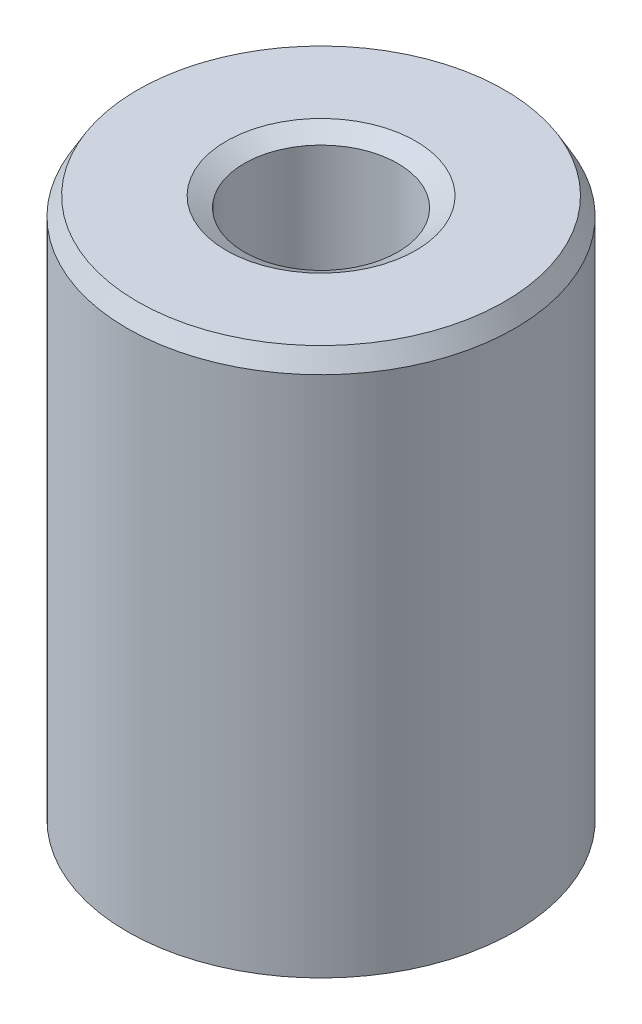
ISO-10303-21;
HEADER;
FILE_DESCRIPTION(('STEP AP214'),'2;1');
FILE_NAME('part.step','',(''),(''),'','','');
FILE_SCHEMA(('AUTOMOTIVE_DESIGN { 1 0 10303 214 1 1 1 1 }'));
ENDSEC;
DATA;
#1=APPLICATION_CONTEXT('core data for automotive mechanical design processes');
#2=APPLICATION_PROTOCOL_DEFINITION('international standard','automotive_design',2000,#1);
#3=PRODUCT_CONTEXT('',#1,'mechanical');
#4=PRODUCT('Part','Part','',(#3));
#5=PRODUCT_RELATED_PRODUCT_CATEGORY('part','',(#4));
#6=PRODUCT_DEFINITION_FORMATION('','',#4);
#7=PRODUCT_DEFINITION_CONTEXT('part definition',#1,'design');
#8=PRODUCT_DEFINITION('design','',#6,#7);
#9=PRODUCT_DEFINITION_SHAPE('','',#8);
#10=(LENGTH_UNIT() NAMED_UNIT(*) SI_UNIT(.MILLI.,.METRE.));
#11=(NAMED_UNIT(*) PLANE_ANGLE_UNIT() SI_UNIT($,.RADIAN.));
#12=(NAMED_UNIT(*) SI_UNIT($,.STERADIAN.) SOLID_ANGLE_UNIT());
#13=UNCERTAINTY_MEASURE_WITH_UNIT(LENGTH_MEASURE(1.E-05),#10,'distance_accuracy_value','');
#14=(GEOMETRIC_REPRESENTATION_CONTEXT(3) GLOBAL_UNCERTAINTY_ASSIGNED_CONTEXT((#13)) GLOBAL_UNIT_ASSIGNED_CONTEXT((#10,
#11,#12)) REPRESENTATION_CONTEXT('',''));
#15=CARTESIAN_POINT('',(0.,0.,0.));
#16=DIRECTION('',(0.,0.,1.));
#17=DIRECTION('',(1.,0.,0.));
#18=AXIS2_PLACEMENT_3D('',#15,#16,#17);
#19=CARTESIAN_POINT('',(0.,56.825706658598,0.));
#20=DIRECTION('',(0.,-1.,0.));
#21=DIRECTION('',(0.,0.,-1.));
#22=AXIS2_PLACEMENT_3D('',#19,#20,#21);
#23=CYLINDRICAL_SURFACE('',#22,20.);
#24=CARTESIAN_POINT('',(0.,1.06899297605855,0.));
#25=DIRECTION('',(0.,1.,0.));
#26=DIRECTION('',(0.,0.,1.));
#27=AXIS2_PLACEMENT_3D('',#24,#25,#26);
#28=CIRCLE('',#27,20.);
#29=CARTESIAN_POINT('',(0.,1.06899297605855,20.));
#30=VERTEX_POINT('',#29);
#31=EDGE_CURVE('E10',#30,#30,#28,.T.);
#32=ORIENTED_EDGE('',*,*,#31,.T.);
#33=EDGE_LOOP('',(#32));
#34=FACE_BOUND('',#33,.T.);
#35=CARTESIAN_POINT('',(0.,54.9741565111303,0.));
#36=DIRECTION('',(0.,1.,0.));
#37=DIRECTION('',(0.,0.,1.));
#38=AXIS2_PLACEMENT_3D('',#35,#36,#37);
#39=CIRCLE('',#38,20.);
#40=CARTESIAN_POINT('',(0.,54.9741565111303,20.));
#41=VERTEX_POINT('',#40);
#42=EDGE_CURVE('E50',#41,#41,#39,.F.);
#43=ORIENTED_EDGE('',*,*,#42,.T.);
#44=EDGE_LOOP('',(#43));
#45=FACE_BOUND('',#44,.T.);
#46=ADVANCED_FACE('F39',(#34,#45),#23,.T.);
#47=CARTESIAN_POINT('',(0.,56.825706658598,0.));
#48=DIRECTION('',(0.,1.,0.));
#49=DIRECTION('',(0.,0.,1.));
#50=AXIS2_PLACEMENT_3D('',#47,#48,#49);
#51=PLANE('',#50);
#52=CARTESIAN_POINT('',(0.,56.825706658598,0.));
#53=DIRECTION('',(0.,1.,0.));
#54=DIRECTION('',(0.,0.,1.));
#55=AXIS2_PLACEMENT_3D('',#52,#53,#54);
#56=CIRCLE('',#55,9.77635911549035);
#57=CARTESIAN_POINT('',(0.,56.825706658598,9.77635911549035));
#58=VERTEX_POINT('',#57);
#59=EDGE_CURVE('E58',#58,#58,#56,.F.);
#60=ORIENTED_EDGE('',*,*,#59,.T.);
#61=EDGE_LOOP('',(#60));
#62=FACE_BOUND('',#61,.T.);
#63=CARTESIAN_POINT('',(0.,56.825706658598,0.));
#64=DIRECTION('',(0.,1.,0.));
#65=DIRECTION('',(0.,0.,1.));
#66=AXIS2_PLACEMENT_3D('',#63,#64,#65);
#67=CIRCLE('',#66,18.9310070239415);
#68=CARTESIAN_POINT('',(0.,56.825706658598,18.9310070239415));
#69=VERTEX_POINT('',#68);
#70=EDGE_CURVE('E61',#69,#69,#67,.T.);
#71=ORIENTED_EDGE('',*,*,#70,.T.);
#72=EDGE_LOOP('',(#71));
#73=FACE_BOUND('',#72,.T.);
#74=ADVANCED_FACE('F88',(#62,#73),#51,.T.);
#75=CARTESIAN_POINT('',(0.,0.,0.));
#76=DIRECTION('',(0.,1.,0.));
#77=DIRECTION('',(0.,0.,1.));
#78=AXIS2_PLACEMENT_3D('',#75,#76,#77);
#79=PLANE('',#78);
#80=CARTESIAN_POINT('',(0.,0.,0.));
#81=DIRECTION('',(0.,1.,0.));
#82=DIRECTION('',(0.,0.,1.));
#83=AXIS2_PLACEMENT_3D('',#80,#81,#82);
#84=CIRCLE('',#83,8.99380194408119);
#85=CARTESIAN_POINT('',(0.,0.,8.99380194408119));
#86=VERTEX_POINT('',#85);
#87=EDGE_CURVE('E51',#86,#86,#84,.T.);
#88=ORIENTED_EDGE('',*,*,#87,.T.);
#89=EDGE_LOOP('',(#88));
#90=FACE_BOUND('',#89,.T.);
#91=CARTESIAN_POINT('',(0.,0.,0.));
#92=DIRECTION('',(0.,1.,0.));
#93=DIRECTION('',(0.,0.,1.));
#94=AXIS2_PLACEMENT_3D('',#91,#92,#93);
#95=CIRCLE('',#94,18.1484498525323);
#96=CARTESIAN_POINT('',(0.,0.,18.1484498525323));
#97=VERTEX_POINT('',#96);
#98=EDGE_CURVE('E54',#97,#97,#95,.F.);
#99=ORIENTED_EDGE('',*,*,#98,.T.);
#100=EDGE_LOOP('',(#99));
#101=FACE_BOUND('',#100,.T.);
#102=ADVANCED_FACE('F83',(#90,#101),#79,.F.);
#103=CARTESIAN_POINT('',(0.,56.825706658598,0.));
#104=DIRECTION('',(0.,-1.,0.));
#105=DIRECTION('',(0.,0.,-1.));
#106=AXIS2_PLACEMENT_3D('',#103,#104,#105);
#107=CYLINDRICAL_SURFACE('',#106,7.92480896802264);
#108=CARTESIAN_POINT('',(0.,55.7567136825394,0.));
#109=DIRECTION('',(0.,1.,0.));
#110=DIRECTION('',(0.,0.,1.));
#111=AXIS2_PLACEMENT_3D('',#108,#109,#110);
#112=CIRCLE('',#111,7.92480896802264);
#113=CARTESIAN_POINT('',(0.,55.7567136825394,7.92480896802264));
#114=VERTEX_POINT('',#113);
#115=EDGE_CURVE('E67',#114,#114,#112,.T.);
#116=ORIENTED_EDGE('',*,*,#115,.T.);
#117=EDGE_LOOP('',(#116));
#118=FACE_BOUND('',#117,.T.);
#119=CARTESIAN_POINT('',(0.,1.85155014746768,0.));
#120=DIRECTION('',(0.,1.,0.));
#121=DIRECTION('',(0.,0.,1.));
#122=AXIS2_PLACEMENT_3D('',#119,#120,#121);
#123=CIRCLE('',#122,7.92480896802264);
#124=CARTESIAN_POINT('',(0.,1.85155014746768,7.92480896802264));
#125=VERTEX_POINT('',#124);
#126=EDGE_CURVE('E69',#125,#125,#123,.F.);
#127=ORIENTED_EDGE('',*,*,#126,.T.);
#128=EDGE_LOOP('',(#127));
#129=FACE_BOUND('',#128,.T.);
#130=ADVANCED_FACE('F71',(#118,#129),#107,.F.);
#131=CARTESIAN_POINT('',(0.,55.7567136825394,0.));
#132=DIRECTION('',(0.,1.,0.));
#133=DIRECTION('',(0.,0.,1.));
#134=AXIS2_PLACEMENT_3D('',#131,#132,#133);
#135=CONICAL_SURFACE('',#134,7.92480896802264,1.0471975511966);
#136=ORIENTED_EDGE('',*,*,#59,.F.);
#137=EDGE_LOOP('',(#136));
#138=FACE_BOUND('',#137,.T.);
#139=ORIENTED_EDGE('',*,*,#115,.F.);
#140=EDGE_LOOP('',(#139));
#141=FACE_BOUND('',#140,.T.);
#142=ADVANCED_FACE('F77',(#138,#141),#135,.F.);
#143=CARTESIAN_POINT('',(0.,0.,0.));
#144=DIRECTION('',(0.,-1.,0.));
#145=DIRECTION('',(0.,0.,-1.));
#146=AXIS2_PLACEMENT_3D('',#143,#144,#145);
#147=CONICAL_SURFACE('',#146,8.99380194408119,0.523598775598297);
#148=ORIENTED_EDGE('',*,*,#126,.F.);
#149=EDGE_LOOP('',(#148));
#150=FACE_BOUND('',#149,.T.);
#151=ORIENTED_EDGE('',*,*,#87,.F.);
#152=EDGE_LOOP('',(#151));
#153=FACE_BOUND('',#152,.T.);
#154=ADVANCED_FACE('F73',(#150,#153),#147,.F.);
#155=CARTESIAN_POINT('',(0.,1.06899297605855,0.));
#156=DIRECTION('',(0.,1.,0.));
#157=DIRECTION('',(0.,0.,1.));
#158=AXIS2_PLACEMENT_3D('',#155,#156,#157);
#159=CONICAL_SURFACE('',#158,20.,1.0471975511966);
#160=ORIENTED_EDGE('',*,*,#98,.F.);
#161=EDGE_LOOP('',(#160));
#162=FACE_BOUND('',#161,.T.);
#163=ORIENTED_EDGE('',*,*,#31,.F.);
#164=EDGE_LOOP('',(#163));
#165=FACE_BOUND('',#164,.T.);
#166=ADVANCED_FACE('F76',(#162,#165),#159,.T.);
#167=CARTESIAN_POINT('',(0.,56.825706658598,0.));
#168=DIRECTION('',(0.,-1.,0.));
#169=DIRECTION('',(0.,0.,-1.));
#170=AXIS2_PLACEMENT_3D('',#167,#168,#169);
#171=CONICAL_SURFACE('',#170,18.9310070239415,0.523598775598294);
#172=ORIENTED_EDGE('',*,*,#42,.F.);
#173=EDGE_LOOP('',(#172));
#174=FACE_BOUND('',#173,.T.);
#175=ORIENTED_EDGE('',*,*,#70,.F.);
#176=EDGE_LOOP('',(#175));
#177=FACE_BOUND('',#176,.T.);
#178=ADVANCED_FACE('F45',(#174,#177),#171,.T.);
#179=CLOSED_SHELL('',(#46,#74,#102,#130,#142,#154,#166,#178));
#180=MANIFOLD_SOLID_BREP('B2',#179);
#181=ADVANCED_BREP_SHAPE_REPRESENTATION('',(#18,#180),#14);
#182=SHAPE_DEFINITION_REPRESENTATION(#9,#181);
ENDSEC;
END-ISO-10303-21;
